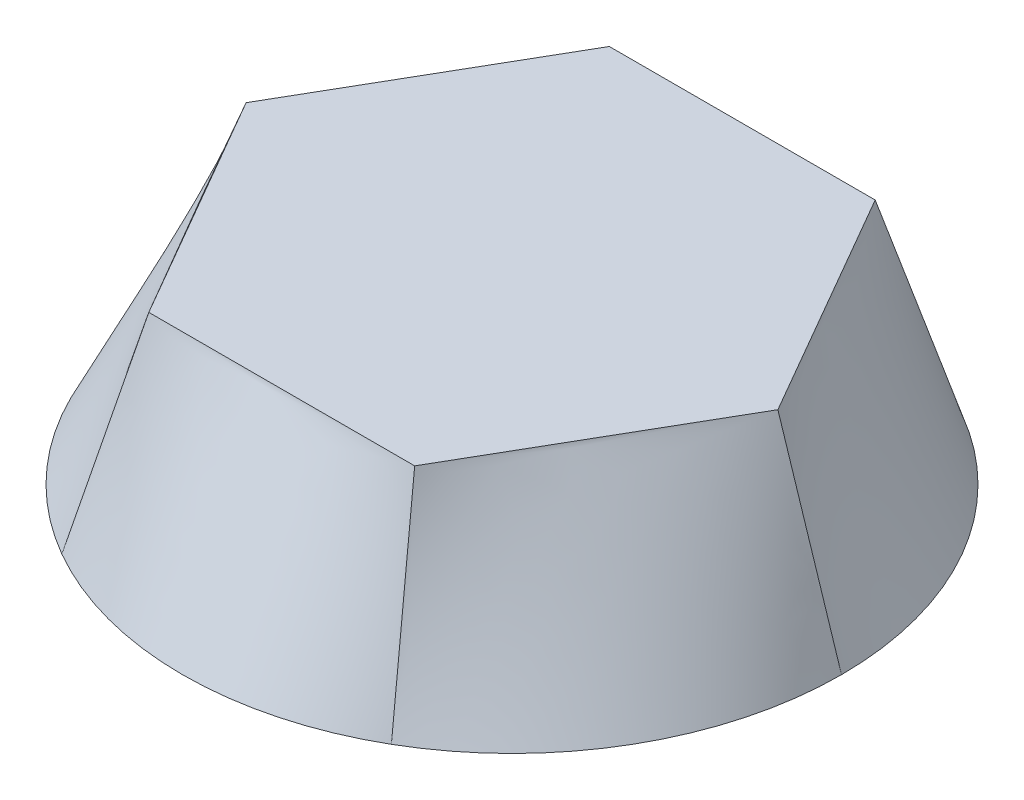
ISO-10303-21;
HEADER;
FILE_DESCRIPTION(('STEP AP214'),'2;1');
FILE_NAME('part.step','',(''),(''),'','','');
FILE_SCHEMA(('AUTOMOTIVE_DESIGN { 1 0 10303 214 1 1 1 1 }'));
ENDSEC;
DATA;
#1=APPLICATION_CONTEXT('core data for automotive mechanical design processes');
#2=APPLICATION_PROTOCOL_DEFINITION('international standard','automotive_design',2000,#1);
#3=PRODUCT_CONTEXT('',#1,'mechanical');
#4=PRODUCT('Part','Part','',(#3));
#5=PRODUCT_RELATED_PRODUCT_CATEGORY('part','',(#4));
#6=PRODUCT_DEFINITION_FORMATION('','',#4);
#7=PRODUCT_DEFINITION_CONTEXT('part definition',#1,'design');
#8=PRODUCT_DEFINITION('design','',#6,#7);
#9=PRODUCT_DEFINITION_SHAPE('','',#8);
#10=(LENGTH_UNIT() NAMED_UNIT(*) SI_UNIT(.MILLI.,.METRE.));
#11=(NAMED_UNIT(*) PLANE_ANGLE_UNIT() SI_UNIT($,.RADIAN.));
#12=(NAMED_UNIT(*) SI_UNIT($,.STERADIAN.) SOLID_ANGLE_UNIT());
#13=UNCERTAINTY_MEASURE_WITH_UNIT(LENGTH_MEASURE(1.E-05),#10,'distance_accuracy_value','');
#14=(GEOMETRIC_REPRESENTATION_CONTEXT(3) GLOBAL_UNCERTAINTY_ASSIGNED_CONTEXT((#13)) GLOBAL_UNIT_ASSIGNED_CONTEXT((#10,
#11,#12)) REPRESENTATION_CONTEXT('',''));
#15=CARTESIAN_POINT('',(0.,0.,0.));
#16=DIRECTION('',(0.,0.,1.));
#17=DIRECTION('',(1.,0.,0.));
#18=AXIS2_PLACEMENT_3D('',#15,#16,#17);
#19=CARTESIAN_POINT('',(0.,15.,0.));
#20=DIRECTION('',(0.,1.,0.));
#21=DIRECTION('',(0.,0.,1.));
#22=AXIS2_PLACEMENT_3D('',#19,#20,#21);
#23=PLANE('',#22);
#24=DIRECTION('',(0.5,0.,-0.866025403784439));
#25=VECTOR('',#24,1.);
#26=CARTESIAN_POINT('',(10.0862631886449,15.,17.4699203012446));
#27=LINE('',#26,#25);
#28=CARTESIAN_POINT('',(10.0862631886449,15.,17.4699203012446));
#29=VERTEX_POINT('',#28);
#30=CARTESIAN_POINT('',(20.1725263772897,15.,0.));
#31=VERTEX_POINT('',#30);
#32=EDGE_CURVE('E174',#29,#31,#27,.T.);
#33=ORIENTED_EDGE('',*,*,#32,.T.);
#34=DIRECTION('',(-0.5,0.,-0.866025403784439));
#35=VECTOR('',#34,1.);
#36=CARTESIAN_POINT('',(20.1725263772897,15.,0.));
#37=LINE('',#36,#35);
#38=CARTESIAN_POINT('',(10.0862631886449,15.,-17.4699203012446));
#39=VERTEX_POINT('',#38);
#40=EDGE_CURVE('E271',#31,#39,#37,.T.);
#41=ORIENTED_EDGE('',*,*,#40,.T.);
#42=DIRECTION('',(-1.,0.,0.));
#43=VECTOR('',#42,1.);
#44=CARTESIAN_POINT('',(10.0862631886449,15.,-17.4699203012446));
#45=LINE('',#44,#43);
#46=CARTESIAN_POINT('',(-10.0862631886449,15.,-17.4699203012446));
#47=VERTEX_POINT('',#46);
#48=EDGE_CURVE('E170',#39,#47,#45,.T.);
#49=ORIENTED_EDGE('',*,*,#48,.T.);
#50=DIRECTION('',(-0.5,0.,0.866025403784439));
#51=VECTOR('',#50,1.);
#52=CARTESIAN_POINT('',(-10.0862631886449,15.,-17.4699203012446));
#53=LINE('',#52,#51);
#54=CARTESIAN_POINT('',(-20.1725263772898,15.,0.));
#55=VERTEX_POINT('',#54);
#56=EDGE_CURVE('E317',#47,#55,#53,.T.);
#57=ORIENTED_EDGE('',*,*,#56,.T.);
#58=DIRECTION('',(0.5,0.,0.866025403784439));
#59=VECTOR('',#58,1.);
#60=CARTESIAN_POINT('',(-20.1725263772898,15.,0.));
#61=LINE('',#60,#59);
#62=CARTESIAN_POINT('',(-10.0862631886449,15.,17.4699203012446));
#63=VERTEX_POINT('',#62);
#64=EDGE_CURVE('E91',#55,#63,#61,.T.);
#65=ORIENTED_EDGE('',*,*,#64,.T.);
#66=DIRECTION('',(1.,0.,0.));
#67=VECTOR('',#66,1.);
#68=CARTESIAN_POINT('',(-10.0862631886449,15.,17.4699203012446));
#69=LINE('',#68,#67);
#70=EDGE_CURVE('E12',#63,#29,#69,.T.);
#71=ORIENTED_EDGE('',*,*,#70,.T.);
#72=EDGE_LOOP('',(#33,#41,#49,#57,#65,#71));
#73=FACE_BOUND('',#72,.T.);
#74=ADVANCED_FACE('F81',(#73),#23,.T.);
#75=CARTESIAN_POINT('',(0.,0.,0.));
#76=DIRECTION('',(0.,1.,0.));
#77=DIRECTION('',(0.,0.,1.));
#78=AXIS2_PLACEMENT_3D('',#75,#76,#77);
#79=PLANE('',#78);
#80=CARTESIAN_POINT('',(0.,0.,0.));
#81=DIRECTION('',(0.,1.,0.));
#82=DIRECTION('',(0.,0.,1.));
#83=AXIS2_PLACEMENT_3D('',#80,#81,#82);
#84=CIRCLE('',#83,25.);
#85=CARTESIAN_POINT('',(12.5,0.,-21.650635094611));
#86=VERTEX_POINT('',#85);
#87=CARTESIAN_POINT('',(-12.5,0.,-21.650635094611));
#88=VERTEX_POINT('',#87);
#89=EDGE_CURVE('E138',#86,#88,#84,.T.);
#90=ORIENTED_EDGE('',*,*,#89,.F.);
#91=CARTESIAN_POINT('',(25.,0.,0.));
#92=VERTEX_POINT('',#91);
#93=EDGE_CURVE('E143',#92,#86,#84,.T.);
#94=ORIENTED_EDGE('',*,*,#93,.F.);
#95=CARTESIAN_POINT('',(12.5,0.,21.650635094611));
#96=VERTEX_POINT('',#95);
#97=EDGE_CURVE('E165',#96,#92,#84,.T.);
#98=ORIENTED_EDGE('',*,*,#97,.F.);
#99=CARTESIAN_POINT('',(-12.5,0.,21.650635094611));
#100=VERTEX_POINT('',#99);
#101=EDGE_CURVE('E397',#100,#96,#84,.T.);
#102=ORIENTED_EDGE('',*,*,#101,.F.);
#103=CARTESIAN_POINT('',(-25.,0.,0.));
#104=VERTEX_POINT('',#103);
#105=EDGE_CURVE('E404',#104,#100,#84,.T.);
#106=ORIENTED_EDGE('',*,*,#105,.F.);
#107=EDGE_CURVE('E146',#88,#104,#84,.T.);
#108=ORIENTED_EDGE('',*,*,#107,.F.);
#109=EDGE_LOOP('',(#90,#94,#98,#102,#106,#108));
#110=FACE_BOUND('',#109,.T.);
#111=ADVANCED_FACE('F141',(#110),#79,.F.);
#112=CARTESIAN_POINT('',(-25.,0.,0.));
#113=CARTESIAN_POINT('',(-20.1725263772898,15.,0.));
#114=CARTESIAN_POINT('',(-25.,0.,2.08333333333333));
#115=CARTESIAN_POINT('',(-19.3320044449027,15.,1.45582669177038));
#116=CARTESIAN_POINT('',(-24.7354772846051,0.,4.23884078171598));
#117=CARTESIAN_POINT('',(-18.4914825125156,15.,2.91165338354077));
#118=CARTESIAN_POINT('',(-23.6193694354999,0.,8.48156796467065));
#119=CARTESIAN_POINT('',(-16.8104386477415,15.,5.82330676708153));
#120=CARTESIAN_POINT('',(-22.767090063074,0.,10.5662432702593));
#121=CARTESIAN_POINT('',(-15.9699167153544,15.,7.27913345885192));
#122=CARTESIAN_POINT('',(-20.534180126148,0.,14.4337567297406));
#123=CARTESIAN_POINT('',(-14.2888728505802,15.,10.1907868423927));
#124=CARTESIAN_POINT('',(-19.154938039079,0.,16.2141899701773));
#125=CARTESIAN_POINT('',(-13.4483509181932,15.,11.6466135341631));
#126=CARTESIAN_POINT('',(-16.0386824418661,0.,19.302131312343));
#127=CARTESIAN_POINT('',(-11.767307053419,15.,14.5582669177038));
#128=CARTESIAN_POINT('',(-14.3042195912176,0.,20.6089684279443));
#129=CARTESIAN_POINT('',(-10.9267851210319,15.,16.0140936094742));
#130=CARTESIAN_POINT('',(-12.5,0.,21.650635094611));
#131=CARTESIAN_POINT('',(-10.0862631886449,15.,17.4699203012446));
#132=B_SPLINE_SURFACE_WITH_KNOTS('',3,1,((#112,#113),(#114,#115),(#116,#117),(#118,#119),(#120,
#121),(#122,#123),(#124,#125),(#126,#127),(#128,#129),(#130,#131)),.UNSPECIFIED.,.F.,.F.,.F.,(4,
2,2,2,4),(2,2),(0.,0.25,0.5,0.75,1.),(0.,1.),.UNSPECIFIED.);
#133=DIRECTION('',(0.153178431185988,0.951916736315524,-0.265312825437822));
#134=VECTOR('',#133,1.);
#135=CARTESIAN_POINT('',(-11.2931315943224,7.5,19.5602776979278));
#136=LINE('',#135,#134);
#137=EDGE_CURVE('E106',#100,#63,#136,.T.);
#138=DIRECTION('',(-0.306356862371975,-0.951916736315524,0.));
#139=VECTOR('',#138,1.);
#140=CARTESIAN_POINT('',(-22.5862631886449,7.5,0.));
#141=LINE('',#140,#139);
#142=EDGE_CURVE('E152',#55,#104,#141,.T.);
#143=ORIENTED_EDGE('',*,*,#105,.T.);
#144=ORIENTED_EDGE('',*,*,#137,.T.);
#145=ORIENTED_EDGE('',*,*,#64,.F.);
#146=ORIENTED_EDGE('',*,*,#142,.T.);
#147=EDGE_LOOP('',(#143,#144,#145,#146));
#148=FACE_BOUND('',#147,.T.);
#149=ADVANCED_FACE('F207',(#148),#132,.T.);
#150=CARTESIAN_POINT('',(-12.5,0.,21.650635094611));
#151=CARTESIAN_POINT('',(-10.0862631886449,15.,17.4699203012446));
#152=CARTESIAN_POINT('',(-10.6957804087824,0.,22.6923017612776));
#153=CARTESIAN_POINT('',(-8.40521932387074,15.,17.4699203012446));
#154=CARTESIAN_POINT('',(-8.69679484273904,0.,23.5409720940589));
#155=CARTESIAN_POINT('',(-6.7241754590966,15.,17.4699203012446));
#156=CARTESIAN_POINT('',(-4.4644313964209,0.,24.695757934848));
#157=CARTESIAN_POINT('',(-3.36208772954831,15.,17.4699203012446));
#158=CARTESIAN_POINT('',(-2.23290993692604,0.,25.));
#159=CARTESIAN_POINT('',(-1.68104386477417,15.,17.4699203012446));
#160=CARTESIAN_POINT('',(2.23290993692601,0.,25.));
#161=CARTESIAN_POINT('',(1.68104386477412,15.,17.4699203012446));
#162=CARTESIAN_POINT('',(4.46443139642087,0.,24.695757934848));
#163=CARTESIAN_POINT('',(3.36208772954826,15.,17.4699203012446));
#164=CARTESIAN_POINT('',(8.69679484273902,0.,23.5409720940589));
#165=CARTESIAN_POINT('',(6.72417545909656,15.,17.4699203012446));
#166=CARTESIAN_POINT('',(10.6957804087824,0.,22.6923017612776));
#167=CARTESIAN_POINT('',(8.40521932387071,15.,17.4699203012446));
#168=CARTESIAN_POINT('',(12.5,0.,21.650635094611));
#169=CARTESIAN_POINT('',(10.0862631886449,15.,17.4699203012446));
#170=B_SPLINE_SURFACE_WITH_KNOTS('',3,1,((#150,#151),(#152,#153),(#154,#155),(#156,#157),(#158,
#159),(#160,#161),(#162,#163),(#164,#165),(#166,#167),(#168,#169)),.UNSPECIFIED.,.F.,.F.,.F.,(4,
2,2,2,4),(2,2),(0.,0.25,0.5,0.75,1.),(0.,1.),.UNSPECIFIED.);
#171=DIRECTION('',(-0.153178431185987,0.951916736315524,-0.265312825437824));
#172=VECTOR('',#171,1.);
#173=CARTESIAN_POINT('',(11.2931315943224,7.5,19.5602776979278));
#174=LINE('',#173,#172);
#175=EDGE_CURVE('E176',#96,#29,#174,.T.);
#176=ORIENTED_EDGE('',*,*,#101,.T.);
#177=ORIENTED_EDGE('',*,*,#175,.T.);
#178=ORIENTED_EDGE('',*,*,#70,.F.);
#179=ORIENTED_EDGE('',*,*,#137,.F.);
#180=EDGE_LOOP('',(#176,#177,#178,#179));
#181=FACE_BOUND('',#180,.T.);
#182=ADVANCED_FACE('F194',(#181),#170,.T.);
#183=CARTESIAN_POINT('',(-12.5,0.,-21.650635094611));
#184=CARTESIAN_POINT('',(-10.0862631886449,15.,-17.4699203012446));
#185=CARTESIAN_POINT('',(-14.3042195912176,0.,-20.6089684279443));
#186=CARTESIAN_POINT('',(-10.9267851210319,15.,-16.0140936094742));
#187=CARTESIAN_POINT('',(-16.0386824418661,0.,-19.302131312343));
#188=CARTESIAN_POINT('',(-11.767307053419,15.,-14.5582669177038));
#189=CARTESIAN_POINT('',(-19.154938039079,0.,-16.2141899701773));
#190=CARTESIAN_POINT('',(-13.4483509181932,15.,-11.646613534163));
#191=CARTESIAN_POINT('',(-20.534180126148,0.,-14.4337567297407));
#192=CARTESIAN_POINT('',(-14.2888728505803,15.,-10.1907868423927));
#193=CARTESIAN_POINT('',(-22.767090063074,0.,-10.5662432702594));
#194=CARTESIAN_POINT('',(-15.9699167153544,15.,-7.27913345885189));
#195=CARTESIAN_POINT('',(-23.6193694354999,0.,-8.48156796467067));
#196=CARTESIAN_POINT('',(-16.8104386477415,15.,-5.8233067670815));
#197=CARTESIAN_POINT('',(-24.7354772846051,0.,-4.23884078171599));
#198=CARTESIAN_POINT('',(-18.4914825125156,15.,-2.91165338354075));
#199=CARTESIAN_POINT('',(-25.,0.,-2.08333333333334));
#200=CARTESIAN_POINT('',(-19.3320044449027,15.,-1.45582669177037));
#201=CARTESIAN_POINT('',(-25.,0.,0.));
#202=CARTESIAN_POINT('',(-20.1725263772898,15.,0.));
#203=B_SPLINE_SURFACE_WITH_KNOTS('',3,1,((#183,#184),(#185,#186),(#187,#188),(#189,#190),(#191,
#192),(#193,#194),(#195,#196),(#197,#198),(#199,#200),(#201,#202)),.UNSPECIFIED.,.F.,.F.,.F.,(4,
2,2,2,4),(2,2),(0.,0.25,0.5,0.75,1.),(0.,1.),.UNSPECIFIED.);
#204=DIRECTION('',(0.153178431185987,0.951916736315524,0.265312825437824));
#205=VECTOR('',#204,1.);
#206=CARTESIAN_POINT('',(-11.2931315943224,7.5,-19.5602776979278));
#207=LINE('',#206,#205);
#208=EDGE_CURVE('E172',#88,#47,#207,.T.);
#209=ORIENTED_EDGE('',*,*,#107,.T.);
#210=ORIENTED_EDGE('',*,*,#142,.F.);
#211=ORIENTED_EDGE('',*,*,#56,.F.);
#212=ORIENTED_EDGE('',*,*,#208,.F.);
#213=EDGE_LOOP('',(#209,#210,#211,#212));
#214=FACE_BOUND('',#213,.T.);
#215=ADVANCED_FACE('F206',(#214),#203,.T.);
#216=CARTESIAN_POINT('',(12.5,0.,21.650635094611));
#217=CARTESIAN_POINT('',(10.0862631886449,15.,17.4699203012446));
#218=CARTESIAN_POINT('',(14.3042195912176,0.,20.6089684279443));
#219=CARTESIAN_POINT('',(10.9267851210319,15.,16.0140936094742));
#220=CARTESIAN_POINT('',(16.0386824418661,0.,19.302131312343));
#221=CARTESIAN_POINT('',(11.767307053419,15.,14.5582669177038));
#222=CARTESIAN_POINT('',(19.154938039079,0.,16.2141899701773));
#223=CARTESIAN_POINT('',(13.4483509181932,15.,11.6466135341631));
#224=CARTESIAN_POINT('',(20.534180126148,0.,14.4337567297407));
#225=CARTESIAN_POINT('',(14.2888728505802,15.,10.1907868423927));
#226=CARTESIAN_POINT('',(22.767090063074,0.,10.5662432702594));
#227=CARTESIAN_POINT('',(15.9699167153544,15.,7.27913345885192));
#228=CARTESIAN_POINT('',(23.6193694354999,0.,8.48156796467065));
#229=CARTESIAN_POINT('',(16.8104386477414,15.,5.82330676708153));
#230=CARTESIAN_POINT('',(24.7354772846051,0.,4.23884078171598));
#231=CARTESIAN_POINT('',(18.4914825125156,15.,2.91165338354077));
#232=CARTESIAN_POINT('',(25.,0.,2.08333333333333));
#233=CARTESIAN_POINT('',(19.3320044449027,15.,1.45582669177038));
#234=CARTESIAN_POINT('',(25.,0.,0.));
#235=CARTESIAN_POINT('',(20.1725263772897,15.,0.));
#236=B_SPLINE_SURFACE_WITH_KNOTS('',3,1,((#216,#217),(#218,#219),(#220,#221),(#222,#223),(#224,
#225),(#226,#227),(#228,#229),(#230,#231),(#232,#233),(#234,#235)),.UNSPECIFIED.,.F.,.F.,.F.,(4,
2,2,2,4),(2,2),(0.,0.25,0.5,0.75,1.),(0.,1.),.UNSPECIFIED.);
#237=DIRECTION('',(-0.306356862371976,0.951916736315524,0.));
#238=VECTOR('',#237,1.);
#239=CARTESIAN_POINT('',(22.5862631886449,7.5,0.));
#240=LINE('',#239,#238);
#241=EDGE_CURVE('E164',#92,#31,#240,.T.);
#242=ORIENTED_EDGE('',*,*,#97,.T.);
#243=ORIENTED_EDGE('',*,*,#241,.T.);
#244=ORIENTED_EDGE('',*,*,#32,.F.);
#245=ORIENTED_EDGE('',*,*,#175,.F.);
#246=EDGE_LOOP('',(#242,#243,#244,#245));
#247=FACE_BOUND('',#246,.T.);
#248=ADVANCED_FACE('F237',(#247),#236,.T.);
#249=CARTESIAN_POINT('',(25.,0.,0.));
#250=CARTESIAN_POINT('',(20.1725263772897,15.,0.));
#251=CARTESIAN_POINT('',(25.,0.,-2.08333333333334));
#252=CARTESIAN_POINT('',(19.3320044449027,15.,-1.45582669177038));
#253=CARTESIAN_POINT('',(24.7354772846051,0.,-4.23884078171598));
#254=CARTESIAN_POINT('',(18.4914825125156,15.,-2.91165338354076));
#255=CARTESIAN_POINT('',(23.6193694354999,0.,-8.48156796467066));
#256=CARTESIAN_POINT('',(16.8104386477414,15.,-5.82330676708152));
#257=CARTESIAN_POINT('',(22.767090063074,0.,-10.5662432702594));
#258=CARTESIAN_POINT('',(15.9699167153544,15.,-7.2791334588519));
#259=CARTESIAN_POINT('',(20.534180126148,0.,-14.4337567297406));
#260=CARTESIAN_POINT('',(14.2888728505802,15.,-10.1907868423927));
#261=CARTESIAN_POINT('',(19.154938039079,0.,-16.2141899701773));
#262=CARTESIAN_POINT('',(13.4483509181932,15.,-11.6466135341631));
#263=CARTESIAN_POINT('',(16.0386824418661,0.,-19.302131312343));
#264=CARTESIAN_POINT('',(11.767307053419,15.,-14.5582669177038));
#265=CARTESIAN_POINT('',(14.3042195912176,0.,-20.6089684279443));
#266=CARTESIAN_POINT('',(10.9267851210319,15.,-16.0140936094742));
#267=CARTESIAN_POINT('',(12.5,0.,-21.650635094611));
#268=CARTESIAN_POINT('',(10.0862631886449,15.,-17.4699203012446));
#269=B_SPLINE_SURFACE_WITH_KNOTS('',3,1,((#249,#250),(#251,#252),(#253,#254),(#255,#256),(#257,
#258),(#259,#260),(#261,#262),(#263,#264),(#265,#266),(#267,#268)),.UNSPECIFIED.,.F.,.F.,.F.,(4,
2,2,2,4),(2,2),(0.,0.25,0.5,0.75,1.),(0.,1.),.UNSPECIFIED.);
#270=DIRECTION('',(-0.153178431185988,0.951916736315524,0.265312825437823));
#271=VECTOR('',#270,1.);
#272=CARTESIAN_POINT('',(11.2931315943224,7.5,-19.5602776979278));
#273=LINE('',#272,#271);
#274=EDGE_CURVE('E161',#86,#39,#273,.T.);
#275=ORIENTED_EDGE('',*,*,#93,.T.);
#276=ORIENTED_EDGE('',*,*,#274,.T.);
#277=ORIENTED_EDGE('',*,*,#40,.F.);
#278=ORIENTED_EDGE('',*,*,#241,.F.);
#279=EDGE_LOOP('',(#275,#276,#277,#278));
#280=FACE_BOUND('',#279,.T.);
#281=ADVANCED_FACE('F160',(#280),#269,.T.);
#282=CARTESIAN_POINT('',(12.5,0.,-21.650635094611));
#283=CARTESIAN_POINT('',(10.0862631886449,15.,-17.4699203012446));
#284=CARTESIAN_POINT('',(10.6957804087824,0.,-22.6923017612776));
#285=CARTESIAN_POINT('',(8.40521932387073,15.,-17.4699203012446));
#286=CARTESIAN_POINT('',(8.69679484273903,0.,-23.540972094059));
#287=CARTESIAN_POINT('',(6.72417545909659,15.,-17.4699203012446));
#288=CARTESIAN_POINT('',(4.46443139642088,0.,-24.695757934848));
#289=CARTESIAN_POINT('',(3.36208772954832,15.,-17.4699203012446));
#290=CARTESIAN_POINT('',(2.23290993692602,0.,-25.));
#291=CARTESIAN_POINT('',(1.68104386477418,15.,-17.4699203012446));
#292=CARTESIAN_POINT('',(-2.23290993692602,0.,-25.));
#293=CARTESIAN_POINT('',(-1.68104386477411,15.,-17.4699203012446));
#294=CARTESIAN_POINT('',(-4.46443139642087,0.,-24.695757934848));
#295=CARTESIAN_POINT('',(-3.36208772954826,15.,-17.4699203012446));
#296=CARTESIAN_POINT('',(-8.69679484273902,0.,-23.540972094059));
#297=CARTESIAN_POINT('',(-6.72417545909656,15.,-17.4699203012446));
#298=CARTESIAN_POINT('',(-10.6957804087824,0.,-22.6923017612776));
#299=CARTESIAN_POINT('',(-8.40521932387071,15.,-17.4699203012446));
#300=CARTESIAN_POINT('',(-12.5,0.,-21.650635094611));
#301=CARTESIAN_POINT('',(-10.0862631886449,15.,-17.4699203012446));
#302=B_SPLINE_SURFACE_WITH_KNOTS('',3,1,((#282,#283),(#284,#285),(#286,#287),(#288,#289),(#290,
#291),(#292,#293),(#294,#295),(#296,#297),(#298,#299),(#300,#301)),.UNSPECIFIED.,.F.,.F.,.F.,(4,
2,2,2,4),(2,2),(0.,0.25,0.5,0.75,1.),(0.,1.),.UNSPECIFIED.);
#303=ORIENTED_EDGE('',*,*,#89,.T.);
#304=ORIENTED_EDGE('',*,*,#208,.T.);
#305=ORIENTED_EDGE('',*,*,#48,.F.);
#306=ORIENTED_EDGE('',*,*,#274,.F.);
#307=EDGE_LOOP('',(#303,#304,#305,#306));
#308=FACE_BOUND('',#307,.T.);
#309=ADVANCED_FACE('F168',(#308),#302,.T.);
#310=CLOSED_SHELL('',(#74,#111,#149,#182,#215,#248,#281,#309));
#311=MANIFOLD_SOLID_BREP('B2',#310);
#312=ADVANCED_BREP_SHAPE_REPRESENTATION('',(#18,#311),#14);
#313=SHAPE_DEFINITION_REPRESENTATION(#9,#312);
ENDSEC;
END-ISO-10303-21;
